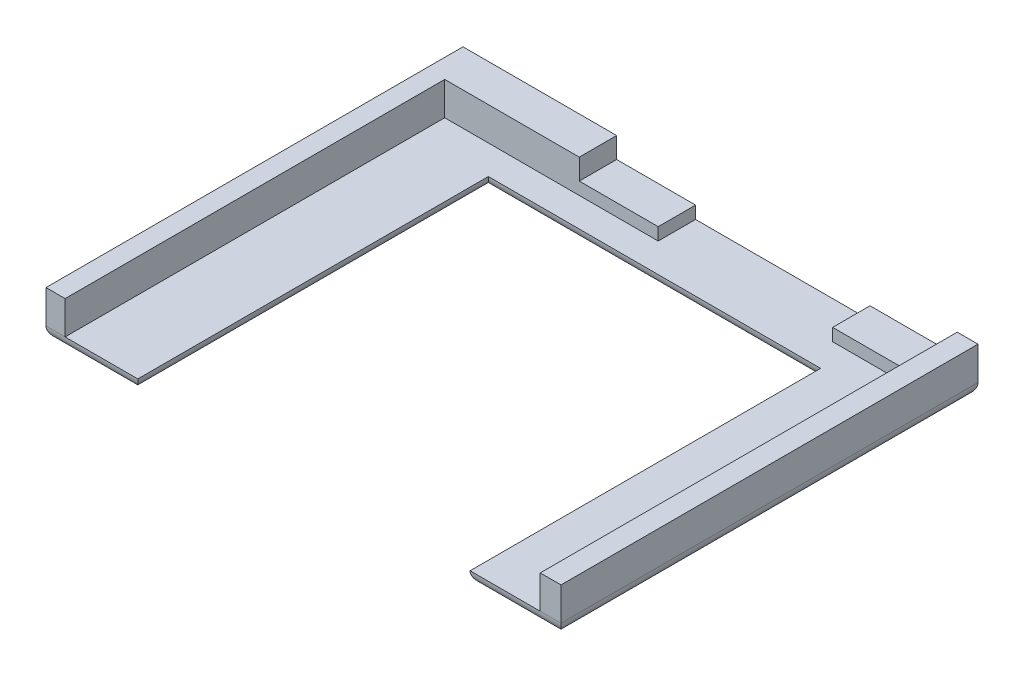
ISO-10303-21;
HEADER;
FILE_DESCRIPTION(('STEP AP214'),'2;1');
FILE_NAME('part.step','',(''),(''),'','','');
FILE_SCHEMA(('AUTOMOTIVE_DESIGN { 1 0 10303 214 1 1 1 1 }'));
ENDSEC;
DATA;
#1=APPLICATION_CONTEXT('core data for automotive mechanical design processes');
#2=APPLICATION_PROTOCOL_DEFINITION('international standard','automotive_design',2000,#1);
#3=PRODUCT_CONTEXT('',#1,'mechanical');
#4=PRODUCT('Part','Part','',(#3));
#5=PRODUCT_RELATED_PRODUCT_CATEGORY('part','',(#4));
#6=PRODUCT_DEFINITION_FORMATION('','',#4);
#7=PRODUCT_DEFINITION_CONTEXT('part definition',#1,'design');
#8=PRODUCT_DEFINITION('design','',#6,#7);
#9=PRODUCT_DEFINITION_SHAPE('','',#8);
#10=(LENGTH_UNIT() NAMED_UNIT(*) SI_UNIT(.MILLI.,.METRE.));
#11=(NAMED_UNIT(*) PLANE_ANGLE_UNIT() SI_UNIT($,.RADIAN.));
#12=(NAMED_UNIT(*) SI_UNIT($,.STERADIAN.) SOLID_ANGLE_UNIT());
#13=UNCERTAINTY_MEASURE_WITH_UNIT(LENGTH_MEASURE(1.E-05),#10,'distance_accuracy_value','');
#14=(GEOMETRIC_REPRESENTATION_CONTEXT(3) GLOBAL_UNCERTAINTY_ASSIGNED_CONTEXT((#13)) GLOBAL_UNIT_ASSIGNED_CONTEXT((#10,
#11,#12)) REPRESENTATION_CONTEXT('',''));
#15=CARTESIAN_POINT('',(0.,0.,0.));
#16=DIRECTION('',(0.,0.,1.));
#17=DIRECTION('',(1.,0.,0.));
#18=AXIS2_PLACEMENT_3D('',#15,#16,#17);
#19=CARTESIAN_POINT('',(-31.,1.5,-25.1));
#20=DIRECTION('',(0.,0.,-1.));
#21=DIRECTION('',(-1.,0.,0.));
#22=AXIS2_PLACEMENT_3D('',#19,#20,#21);
#23=PLANE('',#22);
#24=DIRECTION('',(0.,-1.,0.));
#25=VECTOR('',#24,1.);
#26=CARTESIAN_POINT('',(31.,1.5,-25.1));
#27=LINE('',#26,#25);
#28=CARTESIAN_POINT('',(31.,5.5,-25.1));
#29=VERTEX_POINT('',#28);
#30=CARTESIAN_POINT('',(31.,1.5,-25.1));
#31=VERTEX_POINT('',#30);
#32=EDGE_CURVE('E229',#29,#31,#27,.T.);
#33=ORIENTED_EDGE('',*,*,#32,.T.);
#34=DIRECTION('',(1.,0.,0.));
#35=VECTOR('',#34,1.);
#36=CARTESIAN_POINT('',(-31.,1.5,-25.1));
#37=LINE('',#36,#35);
#38=CARTESIAN_POINT('',(18.,1.5,-25.1));
#39=VERTEX_POINT('',#38);
#40=EDGE_CURVE('E11',#31,#39,#37,.F.);
#41=ORIENTED_EDGE('',*,*,#40,.T.);
#42=DIRECTION('',(0.,1.,0.));
#43=VECTOR('',#42,1.);
#44=CARTESIAN_POINT('',(18.,1.5,-25.1));
#45=LINE('',#44,#43);
#46=CARTESIAN_POINT('',(18.,3.,-25.1));
#47=VERTEX_POINT('',#46);
#48=EDGE_CURVE('E301',#39,#47,#45,.T.);
#49=ORIENTED_EDGE('',*,*,#48,.T.);
#50=DIRECTION('',(-1.,0.,0.));
#51=VECTOR('',#50,1.);
#52=CARTESIAN_POINT('',(31.,3.,-25.1));
#53=LINE('',#52,#51);
#54=CARTESIAN_POINT('',(28.5,3.,-25.1));
#55=VERTEX_POINT('',#54);
#56=EDGE_CURVE('E213',#55,#47,#53,.T.);
#57=ORIENTED_EDGE('',*,*,#56,.F.);
#58=DIRECTION('',(0.,-1.,0.));
#59=VECTOR('',#58,1.);
#60=CARTESIAN_POINT('',(28.5,5.5,-25.1));
#61=LINE('',#60,#59);
#62=CARTESIAN_POINT('',(28.5,5.5,-25.1));
#63=VERTEX_POINT('',#62);
#64=EDGE_CURVE('E349',#63,#55,#61,.T.);
#65=ORIENTED_EDGE('',*,*,#64,.F.);
#66=DIRECTION('',(-1.,0.,0.));
#67=VECTOR('',#66,1.);
#68=CARTESIAN_POINT('',(31.,5.5,-25.1));
#69=LINE('',#68,#67);
#70=EDGE_CURVE('E345',#29,#63,#69,.T.);
#71=ORIENTED_EDGE('',*,*,#70,.F.);
#72=EDGE_LOOP('',(#33,#41,#49,#57,#65,#71));
#73=FACE_BOUND('',#72,.T.);
#74=ADVANCED_FACE('F32',(#73),#23,.T.);
#75=CARTESIAN_POINT('',(31.,3.,-20.6));
#76=DIRECTION('',(0.,0.,-1.));
#77=DIRECTION('',(-1.,0.,0.));
#78=AXIS2_PLACEMENT_3D('',#75,#76,#77);
#79=PLANE('',#78);
#80=DIRECTION('',(0.,1.,0.));
#81=VECTOR('',#80,1.);
#82=CARTESIAN_POINT('',(-3.00000000000001,1.5,-20.6));
#83=LINE('',#82,#81);
#84=CARTESIAN_POINT('',(-3.00000000000001,1.5,-20.6));
#85=VERTEX_POINT('',#84);
#86=CARTESIAN_POINT('',(-3.00000000000001,3.,-20.6));
#87=VERTEX_POINT('',#86);
#88=EDGE_CURVE('E177',#85,#87,#83,.T.);
#89=ORIENTED_EDGE('',*,*,#88,.T.);
#90=DIRECTION('',(1.,0.,0.));
#91=VECTOR('',#90,1.);
#92=CARTESIAN_POINT('',(31.,3.,-20.6));
#93=LINE('',#92,#91);
#94=CARTESIAN_POINT('',(-12.5,3.,-20.6));
#95=VERTEX_POINT('',#94);
#96=EDGE_CURVE('E208',#95,#87,#93,.T.);
#97=ORIENTED_EDGE('',*,*,#96,.F.);
#98=DIRECTION('',(0.,-1.,0.));
#99=VECTOR('',#98,1.);
#100=CARTESIAN_POINT('',(-12.5,5.5,-20.6));
#101=LINE('',#100,#99);
#102=CARTESIAN_POINT('',(-12.5,5.5,-20.6));
#103=VERTEX_POINT('',#102);
#104=EDGE_CURVE('E329',#103,#95,#101,.T.);
#105=ORIENTED_EDGE('',*,*,#104,.F.);
#106=DIRECTION('',(-1.,0.,0.));
#107=VECTOR('',#106,1.);
#108=CARTESIAN_POINT('',(-12.5,5.5,-20.6));
#109=LINE('',#108,#107);
#110=CARTESIAN_POINT('',(-28.7,5.5,-20.6));
#111=VERTEX_POINT('',#110);
#112=EDGE_CURVE('E317',#103,#111,#109,.T.);
#113=ORIENTED_EDGE('',*,*,#112,.T.);
#114=DIRECTION('',(0.,-1.,0.));
#115=VECTOR('',#114,1.);
#116=CARTESIAN_POINT('',(-28.7,5.5,-20.6));
#117=LINE('',#116,#115);
#118=CARTESIAN_POINT('',(-28.7,1.5,-20.6));
#119=VERTEX_POINT('',#118);
#120=EDGE_CURVE('E204',#111,#119,#117,.T.);
#121=ORIENTED_EDGE('',*,*,#120,.T.);
#122=DIRECTION('',(1.,0.,0.));
#123=VECTOR('',#122,1.);
#124=CARTESIAN_POINT('',(31.,1.5,-20.6));
#125=LINE('',#124,#123);
#126=EDGE_CURVE('E195',#119,#85,#125,.T.);
#127=ORIENTED_EDGE('',*,*,#126,.T.);
#128=EDGE_LOOP('',(#89,#97,#105,#113,#121,#127));
#129=FACE_BOUND('',#128,.T.);
#130=ADVANCED_FACE('F202',(#129),#79,.F.);
#131=DIRECTION('',(0.,1.,0.));
#132=VECTOR('',#131,1.);
#133=CARTESIAN_POINT('',(18.,1.5,-20.6));
#134=LINE('',#133,#132);
#135=CARTESIAN_POINT('',(18.,1.5,-20.6));
#136=VERTEX_POINT('',#135);
#137=CARTESIAN_POINT('',(18.,3.,-20.6));
#138=VERTEX_POINT('',#137);
#139=EDGE_CURVE('E188',#136,#138,#134,.T.);
#140=ORIENTED_EDGE('',*,*,#139,.F.);
#141=CARTESIAN_POINT('',(28.5,1.5,-20.6));
#142=VERTEX_POINT('',#141);
#143=EDGE_CURVE('E206',#136,#142,#125,.T.);
#144=ORIENTED_EDGE('',*,*,#143,.T.);
#145=DIRECTION('',(0.,-1.,0.));
#146=VECTOR('',#145,1.);
#147=CARTESIAN_POINT('',(28.5,3.,-20.6));
#148=LINE('',#147,#146);
#149=CARTESIAN_POINT('',(28.5,3.,-20.6));
#150=VERTEX_POINT('',#149);
#151=EDGE_CURVE('E210',#150,#142,#148,.T.);
#152=ORIENTED_EDGE('',*,*,#151,.F.);
#153=EDGE_CURVE('E205',#138,#150,#93,.T.);
#154=ORIENTED_EDGE('',*,*,#153,.F.);
#155=EDGE_LOOP('',(#140,#144,#152,#154));
#156=FACE_BOUND('',#155,.T.);
#157=ADVANCED_FACE('F425',(#156),#79,.F.);
#158=CARTESIAN_POINT('',(0.,3.,0.));
#159=DIRECTION('',(0.,1.,0.));
#160=DIRECTION('',(0.,0.,-1.));
#161=AXIS2_PLACEMENT_3D('',#158,#159,#160);
#162=PLANE('',#161);
#163=ORIENTED_EDGE('',*,*,#96,.T.);
#164=DIRECTION('',(0.,0.,-1.));
#165=VECTOR('',#164,1.);
#166=CARTESIAN_POINT('',(-3.00000000000001,3.,-25.1));
#167=LINE('',#166,#165);
#168=CARTESIAN_POINT('',(-3.00000000000001,3.,-25.1));
#169=VERTEX_POINT('',#168);
#170=EDGE_CURVE('E183',#87,#169,#167,.T.);
#171=ORIENTED_EDGE('',*,*,#170,.T.);
#172=CARTESIAN_POINT('',(-12.5,3.,-25.1));
#173=VERTEX_POINT('',#172);
#174=EDGE_CURVE('E353',#169,#173,#53,.T.);
#175=ORIENTED_EDGE('',*,*,#174,.T.);
#176=DIRECTION('',(0.,0.,-1.));
#177=VECTOR('',#176,1.);
#178=CARTESIAN_POINT('',(-12.5,3.,0.));
#179=LINE('',#178,#177);
#180=EDGE_CURVE('E327',#95,#173,#179,.T.);
#181=ORIENTED_EDGE('',*,*,#180,.F.);
#182=EDGE_LOOP('',(#163,#171,#175,#181));
#183=FACE_BOUND('',#182,.T.);
#184=ADVANCED_FACE('F388',(#183),#162,.T.);
#185=ORIENTED_EDGE('',*,*,#56,.T.);
#186=DIRECTION('',(0.,0.,1.));
#187=VECTOR('',#186,1.);
#188=CARTESIAN_POINT('',(18.,3.,-25.1));
#189=LINE('',#188,#187);
#190=EDGE_CURVE('E200',#47,#138,#189,.T.);
#191=ORIENTED_EDGE('',*,*,#190,.T.);
#192=ORIENTED_EDGE('',*,*,#153,.T.);
#193=DIRECTION('',(0.,0.,-1.));
#194=VECTOR('',#193,1.);
#195=CARTESIAN_POINT('',(28.5,3.,0.));
#196=LINE('',#195,#194);
#197=EDGE_CURVE('E236',#150,#55,#196,.T.);
#198=ORIENTED_EDGE('',*,*,#197,.T.);
#199=EDGE_LOOP('',(#185,#191,#192,#198));
#200=FACE_BOUND('',#199,.T.);
#201=ADVANCED_FACE('F357',(#200),#162,.T.);
#202=DIRECTION('',(0.,1.,0.));
#203=VECTOR('',#202,1.);
#204=CARTESIAN_POINT('',(-3.00000000000001,1.5,-25.1));
#205=LINE('',#204,#203);
#206=CARTESIAN_POINT('',(-3.00000000000001,1.5,-25.1));
#207=VERTEX_POINT('',#206);
#208=EDGE_CURVE('E298',#207,#169,#205,.T.);
#209=ORIENTED_EDGE('',*,*,#208,.F.);
#210=DIRECTION('',(1.,0.,0.));
#211=VECTOR('',#210,1.);
#212=CARTESIAN_POINT('',(-31.,1.5,-25.1));
#213=LINE('',#212,#211);
#214=CARTESIAN_POINT('',(-31.,1.5,-25.1));
#215=VERTEX_POINT('',#214);
#216=EDGE_CURVE('E41',#207,#215,#213,.F.);
#217=ORIENTED_EDGE('',*,*,#216,.T.);
#218=DIRECTION('',(0.,-1.,0.));
#219=VECTOR('',#218,1.);
#220=CARTESIAN_POINT('',(-31.,1.5,-25.1));
#221=LINE('',#220,#219);
#222=CARTESIAN_POINT('',(-31.,5.5,-25.1));
#223=VERTEX_POINT('',#222);
#224=EDGE_CURVE('E226',#223,#215,#221,.T.);
#225=ORIENTED_EDGE('',*,*,#224,.F.);
#226=DIRECTION('',(1.,0.,0.));
#227=VECTOR('',#226,1.);
#228=CARTESIAN_POINT('',(-31.,5.5,-25.1));
#229=LINE('',#228,#227);
#230=CARTESIAN_POINT('',(-12.5,5.5,-25.1));
#231=VERTEX_POINT('',#230);
#232=EDGE_CURVE('E311',#223,#231,#229,.T.);
#233=ORIENTED_EDGE('',*,*,#232,.T.);
#234=DIRECTION('',(0.,-1.,0.));
#235=VECTOR('',#234,1.);
#236=CARTESIAN_POINT('',(-12.5,5.5,-25.1));
#237=LINE('',#236,#235);
#238=EDGE_CURVE('E322',#231,#173,#237,.T.);
#239=ORIENTED_EDGE('',*,*,#238,.T.);
#240=ORIENTED_EDGE('',*,*,#174,.F.);
#241=EDGE_LOOP('',(#209,#217,#225,#233,#239,#240));
#242=FACE_BOUND('',#241,.T.);
#243=ADVANCED_FACE('F376',(#242),#23,.T.);
#244=CARTESIAN_POINT('',(0.,1.5,0.));
#245=DIRECTION('',(0.,1.,0.));
#246=DIRECTION('',(0.,0.,1.));
#247=AXIS2_PLACEMENT_3D('',#244,#245,#246);
#248=PLANE('',#247);
#249=ORIENTED_EDGE('',*,*,#126,.F.);
#250=DIRECTION('',(0.,0.,-1.));
#251=VECTOR('',#250,1.);
#252=CARTESIAN_POINT('',(-28.7,1.5,25.1));
#253=LINE('',#252,#251);
#254=CARTESIAN_POINT('',(-28.7,1.5,25.1));
#255=VERTEX_POINT('',#254);
#256=EDGE_CURVE('E300',#255,#119,#253,.T.);
#257=ORIENTED_EDGE('',*,*,#256,.F.);
#258=DIRECTION('',(1.,0.,0.));
#259=VECTOR('',#258,1.);
#260=CARTESIAN_POINT('',(-31.,1.5,25.1));
#261=LINE('',#260,#259);
#262=CARTESIAN_POINT('',(-19.9486643037038,1.5,25.1));
#263=VERTEX_POINT('',#262);
#264=EDGE_CURVE('E214',#255,#263,#261,.T.);
#265=ORIENTED_EDGE('',*,*,#264,.T.);
#266=DIRECTION('',(0.,0.,1.));
#267=VECTOR('',#266,1.);
#268=CARTESIAN_POINT('',(-19.9486643037038,1.5,-17.1));
#269=LINE('',#268,#267);
#270=CARTESIAN_POINT('',(-19.9486643037038,1.5,-17.1));
#271=VERTEX_POINT('',#270);
#272=EDGE_CURVE('E216',#271,#263,#269,.T.);
#273=ORIENTED_EDGE('',*,*,#272,.F.);
#274=DIRECTION('',(1.,0.,0.));
#275=VECTOR('',#274,1.);
#276=CARTESIAN_POINT('',(-19.9486643037038,1.5,-17.1));
#277=LINE('',#276,#275);
#278=CARTESIAN_POINT('',(20.0513356962962,1.5,-17.1));
#279=VERTEX_POINT('',#278);
#280=EDGE_CURVE('E219',#271,#279,#277,.T.);
#281=ORIENTED_EDGE('',*,*,#280,.T.);
#282=DIRECTION('',(0.,0.,1.));
#283=VECTOR('',#282,1.);
#284=CARTESIAN_POINT('',(20.0513356962962,1.5,-17.1));
#285=LINE('',#284,#283);
#286=CARTESIAN_POINT('',(20.0513356962962,1.5,25.1));
#287=VERTEX_POINT('',#286);
#288=EDGE_CURVE('E221',#279,#287,#285,.T.);
#289=ORIENTED_EDGE('',*,*,#288,.T.);
#290=DIRECTION('',(1.,0.,0.));
#291=VECTOR('',#290,1.);
#292=CARTESIAN_POINT('',(20.0513356962962,1.5,25.1));
#293=LINE('',#292,#291);
#294=CARTESIAN_POINT('',(28.5,1.5,25.1));
#295=VERTEX_POINT('',#294);
#296=EDGE_CURVE('E223',#287,#295,#293,.T.);
#297=ORIENTED_EDGE('',*,*,#296,.T.);
#298=DIRECTION('',(0.,0.,1.));
#299=VECTOR('',#298,1.);
#300=CARTESIAN_POINT('',(28.5,1.5,-25.1));
#301=LINE('',#300,#299);
#302=EDGE_CURVE('E336',#142,#295,#301,.T.);
#303=ORIENTED_EDGE('',*,*,#302,.F.);
#304=ORIENTED_EDGE('',*,*,#143,.F.);
#305=DIRECTION('',(0.,0.,1.));
#306=VECTOR('',#305,1.);
#307=CARTESIAN_POINT('',(18.,1.5,-25.1));
#308=LINE('',#307,#306);
#309=EDGE_CURVE('E199',#39,#136,#308,.T.);
#310=ORIENTED_EDGE('',*,*,#309,.F.);
#311=DIRECTION('',(1.,0.,0.));
#312=VECTOR('',#311,1.);
#313=CARTESIAN_POINT('',(-3.00000000000001,1.5,-25.1));
#314=LINE('',#313,#312);
#315=EDGE_CURVE('E189',#207,#39,#314,.T.);
#316=ORIENTED_EDGE('',*,*,#315,.F.);
#317=DIRECTION('',(0.,0.,-1.));
#318=VECTOR('',#317,1.);
#319=CARTESIAN_POINT('',(-3.00000000000001,1.5,-25.1));
#320=LINE('',#319,#318);
#321=EDGE_CURVE('E180',#85,#207,#320,.T.);
#322=ORIENTED_EDGE('',*,*,#321,.F.);
#323=EDGE_LOOP('',(#249,#257,#265,#273,#281,#289,#297,#303,#304,#310,#316,#322));
#324=FACE_BOUND('',#323,.T.);
#325=ADVANCED_FACE('F193',(#324),#248,.T.);
#326=CARTESIAN_POINT('',(-31.,1.5,-25.1));
#327=DIRECTION('',(1.,0.,0.));
#328=DIRECTION('',(0.,0.,-1.));
#329=AXIS2_PLACEMENT_3D('',#326,#327,#328);
#330=PLANE('',#329);
#331=ORIENTED_EDGE('',*,*,#224,.T.);
#332=DIRECTION('',(0.,0.,1.));
#333=VECTOR('',#332,1.);
#334=CARTESIAN_POINT('',(-31.,1.5,-25.1));
#335=LINE('',#334,#333);
#336=CARTESIAN_POINT('',(-31.,1.5,25.1));
#337=VERTEX_POINT('',#336);
#338=EDGE_CURVE('E259',#215,#337,#335,.T.);
#339=ORIENTED_EDGE('',*,*,#338,.T.);
#340=DIRECTION('',(0.,-1.,0.));
#341=VECTOR('',#340,1.);
#342=CARTESIAN_POINT('',(-31.,1.5,25.1));
#343=LINE('',#342,#341);
#344=CARTESIAN_POINT('',(-31.,5.5,25.1));
#345=VERTEX_POINT('',#344);
#346=EDGE_CURVE('E233',#345,#337,#343,.T.);
#347=ORIENTED_EDGE('',*,*,#346,.F.);
#348=DIRECTION('',(0.,0.,1.));
#349=VECTOR('',#348,1.);
#350=CARTESIAN_POINT('',(-31.,5.5,-25.1));
#351=LINE('',#350,#349);
#352=EDGE_CURVE('E308',#223,#345,#351,.T.);
#353=ORIENTED_EDGE('',*,*,#352,.F.);
#354=EDGE_LOOP('',(#331,#339,#347,#353));
#355=FACE_BOUND('',#354,.T.);
#356=ADVANCED_FACE('F379',(#355),#330,.F.);
#357=CARTESIAN_POINT('',(-31.,1.5,25.1));
#358=DIRECTION('',(0.,0.,-1.));
#359=DIRECTION('',(-1.,0.,0.));
#360=AXIS2_PLACEMENT_3D('',#357,#358,#359);
#361=PLANE('',#360);
#362=ORIENTED_EDGE('',*,*,#346,.T.);
#363=DIRECTION('',(1.,0.,0.));
#364=VECTOR('',#363,1.);
#365=CARTESIAN_POINT('',(-31.,1.5,25.1));
#366=LINE('',#365,#364);
#367=EDGE_CURVE('E239',#337,#255,#366,.T.);
#368=ORIENTED_EDGE('',*,*,#367,.T.);
#369=DIRECTION('',(0.,-1.,0.));
#370=VECTOR('',#369,1.);
#371=CARTESIAN_POINT('',(-28.7,5.5,25.1));
#372=LINE('',#371,#370);
#373=CARTESIAN_POINT('',(-28.7,5.5,25.1));
#374=VERTEX_POINT('',#373);
#375=EDGE_CURVE('E324',#374,#255,#372,.T.);
#376=ORIENTED_EDGE('',*,*,#375,.F.);
#377=DIRECTION('',(1.,0.,0.));
#378=VECTOR('',#377,1.);
#379=CARTESIAN_POINT('',(-31.,5.5,25.1));
#380=LINE('',#379,#378);
#381=EDGE_CURVE('E305',#345,#374,#380,.T.);
#382=ORIENTED_EDGE('',*,*,#381,.F.);
#383=EDGE_LOOP('',(#362,#368,#376,#382));
#384=FACE_BOUND('',#383,.T.);
#385=ADVANCED_FACE('F454',(#384),#361,.F.);
#386=CARTESIAN_POINT('',(20.0513356962962,1.5,25.1));
#387=DIRECTION('',(0.,0.,-1.));
#388=DIRECTION('',(-1.,0.,0.));
#389=AXIS2_PLACEMENT_3D('',#386,#387,#388);
#390=PLANE('',#389);
#391=DIRECTION('',(0.,-1.,0.));
#392=VECTOR('',#391,1.);
#393=CARTESIAN_POINT('',(28.5,5.5,25.1));
#394=LINE('',#393,#392);
#395=CARTESIAN_POINT('',(28.5,5.5,25.1));
#396=VERTEX_POINT('',#395);
#397=EDGE_CURVE('E347',#396,#295,#394,.T.);
#398=ORIENTED_EDGE('',*,*,#397,.T.);
#399=DIRECTION('',(1.,0.,0.));
#400=VECTOR('',#399,1.);
#401=CARTESIAN_POINT('',(20.0513356962962,1.5,25.1));
#402=LINE('',#401,#400);
#403=CARTESIAN_POINT('',(31.,1.5,25.1));
#404=VERTEX_POINT('',#403);
#405=EDGE_CURVE('E57',#295,#404,#402,.T.);
#406=ORIENTED_EDGE('',*,*,#405,.T.);
#407=DIRECTION('',(0.,-1.,0.));
#408=VECTOR('',#407,1.);
#409=CARTESIAN_POINT('',(31.,1.5,25.1));
#410=LINE('',#409,#408);
#411=CARTESIAN_POINT('',(31.,5.5,25.1));
#412=VERTEX_POINT('',#411);
#413=EDGE_CURVE('E231',#412,#404,#410,.T.);
#414=ORIENTED_EDGE('',*,*,#413,.F.);
#415=DIRECTION('',(1.,0.,0.));
#416=VECTOR('',#415,1.);
#417=CARTESIAN_POINT('',(31.,5.5,25.1));
#418=LINE('',#417,#416);
#419=EDGE_CURVE('E340',#396,#412,#418,.T.);
#420=ORIENTED_EDGE('',*,*,#419,.F.);
#421=EDGE_LOOP('',(#398,#406,#414,#420));
#422=FACE_BOUND('',#421,.T.);
#423=ADVANCED_FACE('F450',(#422),#390,.F.);
#424=CARTESIAN_POINT('',(31.,1.5,-25.1));
#425=DIRECTION('',(1.,0.,0.));
#426=DIRECTION('',(0.,0.,-1.));
#427=AXIS2_PLACEMENT_3D('',#424,#425,#426);
#428=PLANE('',#427);
#429=ORIENTED_EDGE('',*,*,#413,.T.);
#430=DIRECTION('',(0.,0.,-1.));
#431=VECTOR('',#430,1.);
#432=CARTESIAN_POINT('',(31.,1.5,-25.1));
#433=LINE('',#432,#431);
#434=EDGE_CURVE('E49',#404,#31,#433,.T.);
#435=ORIENTED_EDGE('',*,*,#434,.T.);
#436=ORIENTED_EDGE('',*,*,#32,.F.);
#437=DIRECTION('',(0.,0.,-1.));
#438=VECTOR('',#437,1.);
#439=CARTESIAN_POINT('',(31.,5.5,-25.1));
#440=LINE('',#439,#438);
#441=EDGE_CURVE('E337',#412,#29,#440,.T.);
#442=ORIENTED_EDGE('',*,*,#441,.F.);
#443=EDGE_LOOP('',(#429,#435,#436,#442));
#444=FACE_BOUND('',#443,.T.);
#445=ADVANCED_FACE('F443',(#444),#428,.T.);
#446=CARTESIAN_POINT('',(0.,0.,0.));
#447=DIRECTION('',(0.,1.,0.));
#448=DIRECTION('',(0.,0.,1.));
#449=AXIS2_PLACEMENT_3D('',#446,#447,#448);
#450=PLANE('',#449);
#451=DIRECTION('',(1.,0.,0.));
#452=VECTOR('',#451,1.);
#453=CARTESIAN_POINT('',(0.,0.,-18.6));
#454=LINE('',#453,#452);
#455=CARTESIAN_POINT('',(21.5513356962962,0.,-18.6));
#456=VERTEX_POINT('',#455);
#457=CARTESIAN_POINT('',(-21.4486643037039,0.,-18.6));
#458=VERTEX_POINT('',#457);
#459=EDGE_CURVE('E255',#456,#458,#454,.F.);
#460=ORIENTED_EDGE('',*,*,#459,.T.);
#461=DIRECTION('',(0.,0.,1.));
#462=VECTOR('',#461,1.);
#463=CARTESIAN_POINT('',(-21.4486643037038,0.,25.1));
#464=LINE('',#463,#462);
#465=CARTESIAN_POINT('',(-21.4486643037038,0.,23.6));
#466=VERTEX_POINT('',#465);
#467=EDGE_CURVE('E257',#458,#466,#464,.T.);
#468=ORIENTED_EDGE('',*,*,#467,.T.);
#469=DIRECTION('',(1.,0.,0.));
#470=VECTOR('',#469,1.);
#471=CARTESIAN_POINT('',(0.,0.,23.6));
#472=LINE('',#471,#470);
#473=CARTESIAN_POINT('',(-29.5,0.,23.6));
#474=VERTEX_POINT('',#473);
#475=EDGE_CURVE('E250',#466,#474,#472,.F.);
#476=ORIENTED_EDGE('',*,*,#475,.T.);
#477=DIRECTION('',(0.,0.,1.));
#478=VECTOR('',#477,1.);
#479=CARTESIAN_POINT('',(-29.5,0.,0.));
#480=LINE('',#479,#478);
#481=CARTESIAN_POINT('',(-29.5,0.,-23.6));
#482=VERTEX_POINT('',#481);
#483=EDGE_CURVE('E248',#474,#482,#480,.F.);
#484=ORIENTED_EDGE('',*,*,#483,.T.);
#485=DIRECTION('',(1.,0.,0.));
#486=VECTOR('',#485,1.);
#487=CARTESIAN_POINT('',(31.,0.,-23.6));
#488=LINE('',#487,#486);
#489=CARTESIAN_POINT('',(29.5,0.,-23.6));
#490=VERTEX_POINT('',#489);
#491=EDGE_CURVE('E242',#482,#490,#488,.T.);
#492=ORIENTED_EDGE('',*,*,#491,.T.);
#493=DIRECTION('',(0.,0.,-1.));
#494=VECTOR('',#493,1.);
#495=CARTESIAN_POINT('',(29.5,0.,25.1));
#496=LINE('',#495,#494);
#497=CARTESIAN_POINT('',(29.5,0.,23.6));
#498=VERTEX_POINT('',#497);
#499=EDGE_CURVE('E244',#490,#498,#496,.F.);
#500=ORIENTED_EDGE('',*,*,#499,.T.);
#501=DIRECTION('',(1.,0.,0.));
#502=VECTOR('',#501,1.);
#503=CARTESIAN_POINT('',(0.,0.,23.6));
#504=LINE('',#503,#502);
#505=CARTESIAN_POINT('',(21.5513356962962,0.,23.6));
#506=VERTEX_POINT('',#505);
#507=EDGE_CURVE('E246',#498,#506,#504,.F.);
#508=ORIENTED_EDGE('',*,*,#507,.T.);
#509=DIRECTION('',(0.,0.,1.));
#510=VECTOR('',#509,1.);
#511=CARTESIAN_POINT('',(21.5513356962962,0.,0.));
#512=LINE('',#511,#510);
#513=EDGE_CURVE('E253',#506,#456,#512,.F.);
#514=ORIENTED_EDGE('',*,*,#513,.T.);
#515=EDGE_LOOP('',(#460,#468,#476,#484,#492,#500,#508,#514));
#516=FACE_BOUND('',#515,.T.);
#517=ADVANCED_FACE('F405',(#516),#450,.F.);
#518=CARTESIAN_POINT('',(28.5,5.5,-25.1));
#519=DIRECTION('',(1.,0.,0.));
#520=DIRECTION('',(0.,0.,-1.));
#521=AXIS2_PLACEMENT_3D('',#518,#519,#520);
#522=PLANE('',#521);
#523=ORIENTED_EDGE('',*,*,#197,.F.);
#524=ORIENTED_EDGE('',*,*,#151,.T.);
#525=ORIENTED_EDGE('',*,*,#302,.T.);
#526=ORIENTED_EDGE('',*,*,#397,.F.);
#527=DIRECTION('',(0.,0.,1.));
#528=VECTOR('',#527,1.);
#529=CARTESIAN_POINT('',(28.5,5.5,-25.1));
#530=LINE('',#529,#528);
#531=EDGE_CURVE('E343',#63,#396,#530,.T.);
#532=ORIENTED_EDGE('',*,*,#531,.F.);
#533=ORIENTED_EDGE('',*,*,#64,.T.);
#534=EDGE_LOOP('',(#523,#524,#525,#526,#532,#533));
#535=FACE_BOUND('',#534,.T.);
#536=ADVANCED_FACE('F440',(#535),#522,.F.);
#537=CARTESIAN_POINT('',(0.,5.5,0.));
#538=DIRECTION('',(0.,1.,0.));
#539=DIRECTION('',(0.,0.,-1.));
#540=AXIS2_PLACEMENT_3D('',#537,#538,#539);
#541=PLANE('',#540);
#542=ORIENTED_EDGE('',*,*,#441,.T.);
#543=ORIENTED_EDGE('',*,*,#70,.T.);
#544=ORIENTED_EDGE('',*,*,#531,.T.);
#545=ORIENTED_EDGE('',*,*,#419,.T.);
#546=EDGE_LOOP('',(#542,#543,#544,#545));
#547=FACE_BOUND('',#546,.T.);
#548=ADVANCED_FACE('F448',(#547),#541,.T.);
#549=CARTESIAN_POINT('',(-28.7,5.5,25.1));
#550=DIRECTION('',(-1.,0.,0.));
#551=DIRECTION('',(0.,0.,1.));
#552=AXIS2_PLACEMENT_3D('',#549,#550,#551);
#553=PLANE('',#552);
#554=ORIENTED_EDGE('',*,*,#256,.T.);
#555=ORIENTED_EDGE('',*,*,#120,.F.);
#556=DIRECTION('',(0.,0.,-1.));
#557=VECTOR('',#556,1.);
#558=CARTESIAN_POINT('',(-28.7,5.5,25.1));
#559=LINE('',#558,#557);
#560=EDGE_CURVE('E319',#374,#111,#559,.T.);
#561=ORIENTED_EDGE('',*,*,#560,.F.);
#562=ORIENTED_EDGE('',*,*,#375,.T.);
#563=EDGE_LOOP('',(#554,#555,#561,#562));
#564=FACE_BOUND('',#563,.T.);
#565=ADVANCED_FACE('F391',(#564),#553,.F.);
#566=CARTESIAN_POINT('',(-12.5,5.5,-25.1));
#567=DIRECTION('',(1.,0.,0.));
#568=DIRECTION('',(0.,0.,-1.));
#569=AXIS2_PLACEMENT_3D('',#566,#567,#568);
#570=PLANE('',#569);
#571=ORIENTED_EDGE('',*,*,#104,.T.);
#572=ORIENTED_EDGE('',*,*,#180,.T.);
#573=ORIENTED_EDGE('',*,*,#238,.F.);
#574=DIRECTION('',(0.,0.,1.));
#575=VECTOR('',#574,1.);
#576=CARTESIAN_POINT('',(-12.5,5.5,-25.1));
#577=LINE('',#576,#575);
#578=EDGE_CURVE('E314',#231,#103,#577,.T.);
#579=ORIENTED_EDGE('',*,*,#578,.T.);
#580=EDGE_LOOP('',(#571,#572,#573,#579));
#581=FACE_BOUND('',#580,.T.);
#582=ADVANCED_FACE('F387',(#581),#570,.T.);
#583=CARTESIAN_POINT('',(0.,5.5,0.));
#584=DIRECTION('',(0.,-1.,0.));
#585=DIRECTION('',(0.,0.,1.));
#586=AXIS2_PLACEMENT_3D('',#583,#584,#585);
#587=PLANE('',#586);
#588=ORIENTED_EDGE('',*,*,#381,.T.);
#589=ORIENTED_EDGE('',*,*,#560,.T.);
#590=ORIENTED_EDGE('',*,*,#112,.F.);
#591=ORIENTED_EDGE('',*,*,#578,.F.);
#592=ORIENTED_EDGE('',*,*,#232,.F.);
#593=ORIENTED_EDGE('',*,*,#352,.T.);
#594=EDGE_LOOP('',(#588,#589,#590,#591,#592,#593));
#595=FACE_BOUND('',#594,.T.);
#596=ADVANCED_FACE('F384',(#595),#587,.F.);
#597=CARTESIAN_POINT('',(-3.00000000000001,1.5,-25.1));
#598=DIRECTION('',(1.,0.,0.));
#599=DIRECTION('',(0.,0.,-1.));
#600=AXIS2_PLACEMENT_3D('',#597,#598,#599);
#601=PLANE('',#600);
#602=ORIENTED_EDGE('',*,*,#170,.F.);
#603=ORIENTED_EDGE('',*,*,#88,.F.);
#604=ORIENTED_EDGE('',*,*,#321,.T.);
#605=ORIENTED_EDGE('',*,*,#208,.T.);
#606=EDGE_LOOP('',(#602,#603,#604,#605));
#607=FACE_BOUND('',#606,.T.);
#608=ADVANCED_FACE('F179',(#607),#601,.T.);
#609=CARTESIAN_POINT('',(18.,1.5,-25.1));
#610=DIRECTION('',(-1.,0.,0.));
#611=DIRECTION('',(0.,0.,1.));
#612=AXIS2_PLACEMENT_3D('',#609,#610,#611);
#613=PLANE('',#612);
#614=ORIENTED_EDGE('',*,*,#190,.F.);
#615=ORIENTED_EDGE('',*,*,#48,.F.);
#616=ORIENTED_EDGE('',*,*,#309,.T.);
#617=ORIENTED_EDGE('',*,*,#139,.T.);
#618=EDGE_LOOP('',(#614,#615,#616,#617));
#619=FACE_BOUND('',#618,.T.);
#620=ADVANCED_FACE('F367',(#619),#613,.T.);
#621=CARTESIAN_POINT('',(20.0513356962962,1.5,23.6));
#622=DIRECTION('',(1.,0.,0.));
#623=DIRECTION('',(0.,0.,-1.));
#624=AXIS2_PLACEMENT_3D('',#621,#622,#623);
#625=CYLINDRICAL_SURFACE('',#624,1.5);
#626=CARTESIAN_POINT('',(21.5513356962962,1.5,23.6));
#627=DIRECTION('',(0.707106781186548,0.,0.707106781186547));
#628=DIRECTION('',(-0.707106781186547,0.,0.707106781186548));
#629=AXIS2_PLACEMENT_3D('',#626,#627,#628);
#630=ELLIPSE('',#629,2.12132034355964,1.5);
#631=EDGE_CURVE('E280',#506,#287,#630,.F.);
#632=ORIENTED_EDGE('',*,*,#631,.F.);
#633=ORIENTED_EDGE('',*,*,#507,.F.);
#634=CARTESIAN_POINT('',(29.5,1.5,23.6));
#635=DIRECTION('',(-0.707106781186547,0.,0.707106781186548));
#636=DIRECTION('',(0.707106781186548,0.,0.707106781186547));
#637=AXIS2_PLACEMENT_3D('',#634,#635,#636);
#638=ELLIPSE('',#637,2.12132034355964,1.5);
#639=EDGE_CURVE('E36',#404,#498,#638,.F.);
#640=ORIENTED_EDGE('',*,*,#639,.F.);
#641=ORIENTED_EDGE('',*,*,#405,.F.);
#642=ORIENTED_EDGE('',*,*,#296,.F.);
#643=EDGE_LOOP('',(#632,#633,#640,#641,#642));
#644=FACE_BOUND('',#643,.T.);
#645=ADVANCED_FACE('F34',(#644),#625,.T.);
#646=CARTESIAN_POINT('',(29.5,1.5,-25.1));
#647=DIRECTION('',(0.,0.,1.));
#648=DIRECTION('',(1.,0.,0.));
#649=AXIS2_PLACEMENT_3D('',#646,#647,#648);
#650=CYLINDRICAL_SURFACE('',#649,1.5);
#651=ORIENTED_EDGE('',*,*,#639,.T.);
#652=ORIENTED_EDGE('',*,*,#499,.F.);
#653=CARTESIAN_POINT('',(29.5,1.5,-23.6));
#654=DIRECTION('',(-0.707106781186548,0.,-0.707106781186547));
#655=DIRECTION('',(-0.707106781186547,0.,0.707106781186548));
#656=AXIS2_PLACEMENT_3D('',#653,#654,#655);
#657=ELLIPSE('',#656,2.12132034355964,1.5);
#658=EDGE_CURVE('E278',#31,#490,#657,.T.);
#659=ORIENTED_EDGE('',*,*,#658,.F.);
#660=ORIENTED_EDGE('',*,*,#434,.F.);
#661=EDGE_LOOP('',(#651,#652,#659,#660));
#662=FACE_BOUND('',#661,.T.);
#663=ADVANCED_FACE('F413',(#662),#650,.T.);
#664=CARTESIAN_POINT('',(21.5513356962962,1.5,-17.1));
#665=DIRECTION('',(0.,0.,1.));
#666=DIRECTION('',(1.,0.,0.));
#667=AXIS2_PLACEMENT_3D('',#664,#665,#666);
#668=CYLINDRICAL_SURFACE('',#667,1.5);
#669=ORIENTED_EDGE('',*,*,#631,.T.);
#670=ORIENTED_EDGE('',*,*,#288,.F.);
#671=CARTESIAN_POINT('',(21.5513356962962,1.5,-18.6));
#672=DIRECTION('',(0.707106781186548,0.,0.707106781186547));
#673=DIRECTION('',(0.707106781186547,0.,-0.707106781186548));
#674=AXIS2_PLACEMENT_3D('',#671,#672,#673);
#675=ELLIPSE('',#674,2.12132034355964,1.5);
#676=EDGE_CURVE('E275',#456,#279,#675,.F.);
#677=ORIENTED_EDGE('',*,*,#676,.F.);
#678=ORIENTED_EDGE('',*,*,#513,.F.);
#679=EDGE_LOOP('',(#669,#670,#677,#678));
#680=FACE_BOUND('',#679,.T.);
#681=ADVANCED_FACE('F411',(#680),#668,.T.);
#682=CARTESIAN_POINT('',(0.,1.5,-23.6));
#683=DIRECTION('',(-1.,0.,0.));
#684=DIRECTION('',(0.,0.,1.));
#685=AXIS2_PLACEMENT_3D('',#682,#683,#684);
#686=CYLINDRICAL_SURFACE('',#685,1.5);
#687=ORIENTED_EDGE('',*,*,#658,.T.);
#688=ORIENTED_EDGE('',*,*,#491,.F.);
#689=CARTESIAN_POINT('',(-29.5,1.5,-23.6));
#690=DIRECTION('',(-0.707106781186547,0.,0.707106781186548));
#691=DIRECTION('',(-0.707106781186548,0.,-0.707106781186547));
#692=AXIS2_PLACEMENT_3D('',#689,#690,#691);
#693=ELLIPSE('',#692,2.12132034355964,1.5);
#694=EDGE_CURVE('E272',#215,#482,#693,.T.);
#695=ORIENTED_EDGE('',*,*,#694,.F.);
#696=ORIENTED_EDGE('',*,*,#216,.F.);
#697=ORIENTED_EDGE('',*,*,#315,.T.);
#698=ORIENTED_EDGE('',*,*,#40,.F.);
#699=EDGE_LOOP('',(#687,#688,#695,#696,#697,#698));
#700=FACE_BOUND('',#699,.T.);
#701=ADVANCED_FACE('F371',(#700),#686,.T.);
#702=CARTESIAN_POINT('',(-19.9486643037038,1.5,-18.6));
#703=DIRECTION('',(1.,0.,0.));
#704=DIRECTION('',(0.,0.,-1.));
#705=AXIS2_PLACEMENT_3D('',#702,#703,#704);
#706=CYLINDRICAL_SURFACE('',#705,1.5);
#707=ORIENTED_EDGE('',*,*,#676,.T.);
#708=ORIENTED_EDGE('',*,*,#280,.F.);
#709=CARTESIAN_POINT('',(-21.4486643037039,1.5,-18.6));
#710=DIRECTION('',(0.707106781186547,0.,-0.707106781186548));
#711=DIRECTION('',(-0.707106781186548,0.,-0.707106781186547));
#712=AXIS2_PLACEMENT_3D('',#709,#710,#711);
#713=ELLIPSE('',#712,2.12132034355964,1.5);
#714=EDGE_CURVE('E269',#458,#271,#713,.F.);
#715=ORIENTED_EDGE('',*,*,#714,.F.);
#716=ORIENTED_EDGE('',*,*,#459,.F.);
#717=EDGE_LOOP('',(#707,#708,#715,#716));
#718=FACE_BOUND('',#717,.T.);
#719=ADVANCED_FACE('F409',(#718),#706,.T.);
#720=CARTESIAN_POINT('',(-29.5,1.5,-25.1));
#721=DIRECTION('',(0.,0.,1.));
#722=DIRECTION('',(1.,0.,0.));
#723=AXIS2_PLACEMENT_3D('',#720,#721,#722);
#724=CYLINDRICAL_SURFACE('',#723,1.5);
#725=ORIENTED_EDGE('',*,*,#694,.T.);
#726=ORIENTED_EDGE('',*,*,#483,.F.);
#727=CARTESIAN_POINT('',(-29.5,1.5,23.6));
#728=DIRECTION('',(0.707106781186548,0.,0.707106781186547));
#729=DIRECTION('',(-0.707106781186547,0.,0.707106781186548));
#730=AXIS2_PLACEMENT_3D('',#727,#728,#729);
#731=ELLIPSE('',#730,2.12132034355964,1.5);
#732=EDGE_CURVE('E267',#337,#474,#731,.T.);
#733=ORIENTED_EDGE('',*,*,#732,.F.);
#734=ORIENTED_EDGE('',*,*,#338,.F.);
#735=EDGE_LOOP('',(#725,#726,#733,#734));
#736=FACE_BOUND('',#735,.T.);
#737=ADVANCED_FACE('F466',(#736),#724,.T.);
#738=CARTESIAN_POINT('',(-21.4486643037038,1.5,0.));
#739=DIRECTION('',(0.,0.,-1.));
#740=DIRECTION('',(-1.,0.,0.));
#741=AXIS2_PLACEMENT_3D('',#738,#739,#740);
#742=CYLINDRICAL_SURFACE('',#741,1.5);
#743=ORIENTED_EDGE('',*,*,#714,.T.);
#744=ORIENTED_EDGE('',*,*,#272,.T.);
#745=CARTESIAN_POINT('',(-21.4486643037038,1.5,23.6));
#746=DIRECTION('',(0.707106781186547,0.,-0.707106781186548));
#747=DIRECTION('',(-0.707106781186548,0.,-0.707106781186547));
#748=AXIS2_PLACEMENT_3D('',#745,#746,#747);
#749=ELLIPSE('',#748,2.12132034355964,1.5);
#750=EDGE_CURVE('E264',#466,#263,#749,.F.);
#751=ORIENTED_EDGE('',*,*,#750,.F.);
#752=ORIENTED_EDGE('',*,*,#467,.F.);
#753=EDGE_LOOP('',(#743,#744,#751,#752));
#754=FACE_BOUND('',#753,.T.);
#755=ADVANCED_FACE('F397',(#754),#742,.T.);
#756=CARTESIAN_POINT('',(-31.,1.5,23.6));
#757=DIRECTION('',(1.,0.,0.));
#758=DIRECTION('',(0.,0.,-1.));
#759=AXIS2_PLACEMENT_3D('',#756,#757,#758);
#760=CYLINDRICAL_SURFACE('',#759,1.5);
#761=ORIENTED_EDGE('',*,*,#732,.T.);
#762=ORIENTED_EDGE('',*,*,#475,.F.);
#763=ORIENTED_EDGE('',*,*,#750,.T.);
#764=ORIENTED_EDGE('',*,*,#264,.F.);
#765=ORIENTED_EDGE('',*,*,#367,.F.);
#766=EDGE_LOOP('',(#761,#762,#763,#764,#765));
#767=FACE_BOUND('',#766,.T.);
#768=ADVANCED_FACE('F401',(#767),#760,.T.);
#769=CLOSED_SHELL('',(#74,#130,#157,#184,#201,#243,#325,#356,#385,#423,#445,#517,#536,#548,#565,
#582,#596,#608,#620,#645,#663,#681,#701,#719,#737,#755,#768));
#770=MANIFOLD_SOLID_BREP('B2',#769);
#771=ADVANCED_BREP_SHAPE_REPRESENTATION('',(#18,#770),#14);
#772=SHAPE_DEFINITION_REPRESENTATION(#9,#771);
ENDSEC;
END-ISO-10303-21;
